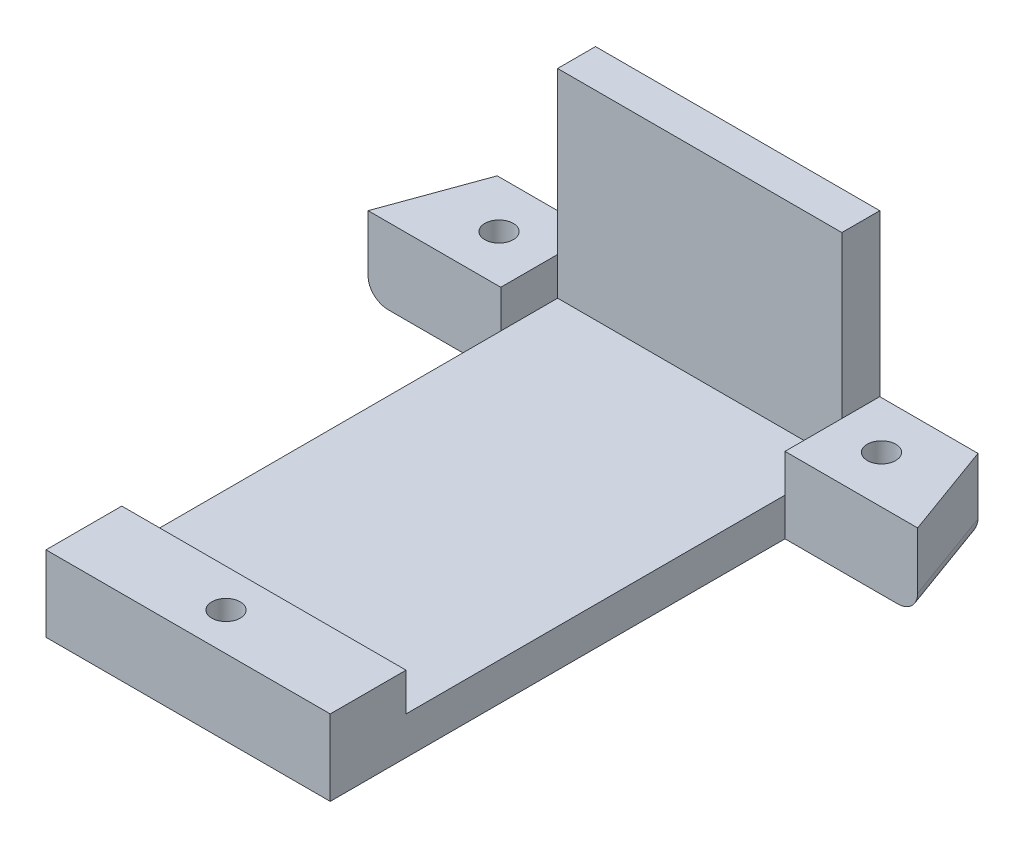
ISO-10303-21;
HEADER;
FILE_DESCRIPTION(('STEP AP214'),'2;1');
FILE_NAME('part.step','',(''),(''),'','','');
FILE_SCHEMA(('AUTOMOTIVE_DESIGN { 1 0 10303 214 1 1 1 1 }'));
ENDSEC;
DATA;
#1=APPLICATION_CONTEXT('core data for automotive mechanical design processes');
#2=APPLICATION_PROTOCOL_DEFINITION('international standard','automotive_design',2000,#1);
#3=PRODUCT_CONTEXT('',#1,'mechanical');
#4=PRODUCT('Part','Part','',(#3));
#5=PRODUCT_RELATED_PRODUCT_CATEGORY('part','',(#4));
#6=PRODUCT_DEFINITION_FORMATION('','',#4);
#7=PRODUCT_DEFINITION_CONTEXT('part definition',#1,'design');
#8=PRODUCT_DEFINITION('design','',#6,#7);
#9=PRODUCT_DEFINITION_SHAPE('','',#8);
#10=(LENGTH_UNIT() NAMED_UNIT(*) SI_UNIT(.MILLI.,.METRE.));
#11=(NAMED_UNIT(*) PLANE_ANGLE_UNIT() SI_UNIT($,.RADIAN.));
#12=(NAMED_UNIT(*) SI_UNIT($,.STERADIAN.) SOLID_ANGLE_UNIT());
#13=UNCERTAINTY_MEASURE_WITH_UNIT(LENGTH_MEASURE(1.E-05),#10,'distance_accuracy_value','');
#14=(GEOMETRIC_REPRESENTATION_CONTEXT(3) GLOBAL_UNCERTAINTY_ASSIGNED_CONTEXT((#13)) GLOBAL_UNIT_ASSIGNED_CONTEXT((#10,
#11,#12)) REPRESENTATION_CONTEXT('',''));
#15=CARTESIAN_POINT('',(0.,0.,0.));
#16=DIRECTION('',(0.,0.,1.));
#17=DIRECTION('',(1.,0.,0.));
#18=AXIS2_PLACEMENT_3D('',#15,#16,#17);
#19=CARTESIAN_POINT('',(0.,8.,29.));
#20=DIRECTION('',(0.,-1.,0.));
#21=DIRECTION('',(0.,0.,-1.));
#22=AXIS2_PLACEMENT_3D('',#19,#20,#21);
#23=CYLINDRICAL_SURFACE('',#22,1.5);
#24=CARTESIAN_POINT('',(0.,8.,29.));
#25=DIRECTION('',(0.,1.,0.));
#26=DIRECTION('',(0.,0.,1.));
#27=AXIS2_PLACEMENT_3D('',#24,#25,#26);
#28=CIRCLE('',#27,1.5);
#29=CARTESIAN_POINT('',(0.,8.,30.5));
#30=VERTEX_POINT('',#29);
#31=EDGE_CURVE('E319',#30,#30,#28,.T.);
#32=ORIENTED_EDGE('',*,*,#31,.T.);
#33=EDGE_LOOP('',(#32));
#34=FACE_BOUND('',#33,.T.);
#35=CARTESIAN_POINT('',(0.,4.,29.));
#36=DIRECTION('',(0.,-1.,0.));
#37=DIRECTION('',(0.,0.,-1.));
#38=AXIS2_PLACEMENT_3D('',#35,#36,#37);
#39=CIRCLE('',#38,1.5);
#40=CARTESIAN_POINT('',(0.,4.,27.5));
#41=VERTEX_POINT('',#40);
#42=EDGE_CURVE('E221',#41,#41,#39,.T.);
#43=ORIENTED_EDGE('',*,*,#42,.T.);
#44=EDGE_LOOP('',(#43));
#45=FACE_BOUND('',#44,.T.);
#46=ADVANCED_FACE('F39',(#34,#45),#23,.F.);
#47=CARTESIAN_POINT('',(-20.185,8.,-20.));
#48=DIRECTION('',(0.,-1.,0.));
#49=DIRECTION('',(0.,0.,-1.));
#50=AXIS2_PLACEMENT_3D('',#47,#48,#49);
#51=CYLINDRICAL_SURFACE('',#50,1.5);
#52=CARTESIAN_POINT('',(-20.185,8.,-20.));
#53=DIRECTION('',(0.,1.,0.));
#54=DIRECTION('',(0.,0.,1.));
#55=AXIS2_PLACEMENT_3D('',#52,#53,#54);
#56=CIRCLE('',#55,1.5);
#57=CARTESIAN_POINT('',(-20.185,8.,-18.5));
#58=VERTEX_POINT('',#57);
#59=EDGE_CURVE('E287',#58,#58,#56,.T.);
#60=ORIENTED_EDGE('',*,*,#59,.T.);
#61=EDGE_LOOP('',(#60));
#62=FACE_BOUND('',#61,.T.);
#63=CARTESIAN_POINT('',(-20.185,4.,-20.));
#64=DIRECTION('',(0.,-1.,0.));
#65=DIRECTION('',(0.,0.,-1.));
#66=AXIS2_PLACEMENT_3D('',#63,#64,#65);
#67=CIRCLE('',#66,1.5);
#68=CARTESIAN_POINT('',(-20.185,4.,-21.5));
#69=VERTEX_POINT('',#68);
#70=EDGE_CURVE('E376',#69,#69,#67,.T.);
#71=ORIENTED_EDGE('',*,*,#70,.T.);
#72=EDGE_LOOP('',(#71));
#73=FACE_BOUND('',#72,.T.);
#74=ADVANCED_FACE('F482',(#62,#73),#51,.F.);
#75=CARTESIAN_POINT('',(20.185,8.,-20.));
#76=DIRECTION('',(0.,-1.,0.));
#77=DIRECTION('',(0.,0.,-1.));
#78=AXIS2_PLACEMENT_3D('',#75,#76,#77);
#79=CYLINDRICAL_SURFACE('',#78,1.50000000000001);
#80=CARTESIAN_POINT('',(20.185,8.,-20.));
#81=DIRECTION('',(0.,1.,0.));
#82=DIRECTION('',(0.,0.,1.));
#83=AXIS2_PLACEMENT_3D('',#80,#81,#82);
#84=CIRCLE('',#83,1.50000000000001);
#85=CARTESIAN_POINT('',(20.185,8.,-18.5));
#86=VERTEX_POINT('',#85);
#87=EDGE_CURVE('E323',#86,#86,#84,.F.);
#88=ORIENTED_EDGE('',*,*,#87,.F.);
#89=EDGE_LOOP('',(#88));
#90=FACE_BOUND('',#89,.T.);
#91=CARTESIAN_POINT('',(20.185,4.,-20.));
#92=DIRECTION('',(0.,-1.,0.));
#93=DIRECTION('',(0.,0.,-1.));
#94=AXIS2_PLACEMENT_3D('',#91,#92,#93);
#95=CIRCLE('',#94,1.50000000000001);
#96=CARTESIAN_POINT('',(20.185,4.,-21.5));
#97=VERTEX_POINT('',#96);
#98=EDGE_CURVE('E372',#97,#97,#95,.F.);
#99=ORIENTED_EDGE('',*,*,#98,.F.);
#100=EDGE_LOOP('',(#99));
#101=FACE_BOUND('',#100,.T.);
#102=ADVANCED_FACE('F479',(#90,#101),#79,.F.);
#103=CARTESIAN_POINT('',(0.,8.,0.));
#104=DIRECTION('',(0.,1.,0.));
#105=DIRECTION('',(0.,0.,1.));
#106=AXIS2_PLACEMENT_3D('',#103,#104,#105);
#107=PLANE('',#106);
#108=DIRECTION('',(0.,0.,-1.));
#109=VECTOR('',#108,1.);
#110=CARTESIAN_POINT('',(15.,8.,-15.));
#111=LINE('',#110,#109);
#112=CARTESIAN_POINT('',(15.,8.,-15.));
#113=VERTEX_POINT('',#112);
#114=CARTESIAN_POINT('',(15.,8.,-21.));
#115=VERTEX_POINT('',#114);
#116=EDGE_CURVE('E208',#113,#115,#111,.T.);
#117=ORIENTED_EDGE('',*,*,#116,.F.);
#118=DIRECTION('',(-1.,0.,0.));
#119=VECTOR('',#118,1.);
#120=CARTESIAN_POINT('',(0.,8.,-15.));
#121=LINE('',#120,#119);
#122=CARTESIAN_POINT('',(29.,8.,-15.));
#123=VERTEX_POINT('',#122);
#124=EDGE_CURVE('E297',#123,#113,#121,.T.);
#125=ORIENTED_EDGE('',*,*,#124,.F.);
#126=DIRECTION('',(-0.341214696131743,0.,-0.939985388792678));
#127=VECTOR('',#126,1.);
#128=CARTESIAN_POINT('',(30.4346558352455,8.,-11.0477800681941));
#129=LINE('',#128,#127);
#130=CARTESIAN_POINT('',(25.37,8.,-25.));
#131=VERTEX_POINT('',#130);
#132=EDGE_CURVE('E311',#123,#131,#129,.T.);
#133=ORIENTED_EDGE('',*,*,#132,.T.);
#134=DIRECTION('',(-1.,0.,0.));
#135=VECTOR('',#134,1.);
#136=CARTESIAN_POINT('',(0.,8.,-25.));
#137=LINE('',#136,#135);
#138=CARTESIAN_POINT('',(15.,8.,-25.));
#139=VERTEX_POINT('',#138);
#140=EDGE_CURVE('E316',#131,#139,#137,.T.);
#141=ORIENTED_EDGE('',*,*,#140,.T.);
#142=DIRECTION('',(0.,0.,-1.));
#143=VECTOR('',#142,1.);
#144=CARTESIAN_POINT('',(15.,8.,-21.));
#145=LINE('',#144,#143);
#146=EDGE_CURVE('E249',#115,#139,#145,.T.);
#147=ORIENTED_EDGE('',*,*,#146,.F.);
#148=EDGE_LOOP('',(#117,#125,#133,#141,#147));
#149=FACE_BOUND('',#148,.T.);
#150=ORIENTED_EDGE('',*,*,#87,.T.);
#151=EDGE_LOOP('',(#150));
#152=FACE_BOUND('',#151,.T.);
#153=ADVANCED_FACE('F474',(#149,#152),#107,.T.);
#154=CARTESIAN_POINT('',(0.,8.,-15.));
#155=DIRECTION('',(0.,0.,-1.));
#156=DIRECTION('',(-1.,0.,0.));
#157=AXIS2_PLACEMENT_3D('',#154,#155,#156);
#158=PLANE('',#157);
#159=DIRECTION('',(1.,0.,0.));
#160=VECTOR('',#159,1.);
#161=CARTESIAN_POINT('',(0.,0.,-15.));
#162=LINE('',#161,#160);
#163=CARTESIAN_POINT('',(15.,0.,-15.));
#164=VERTEX_POINT('',#163);
#165=CARTESIAN_POINT('',(26.872307353023,0.,-15.));
#166=VERTEX_POINT('',#165);
#167=EDGE_CURVE('E292',#164,#166,#162,.T.);
#168=ORIENTED_EDGE('',*,*,#167,.T.);
#169=CARTESIAN_POINT('',(26.872307353023,2.,-15.));
#170=DIRECTION('',(0.,0.,-1.));
#171=DIRECTION('',(-1.,0.,0.));
#172=AXIS2_PLACEMENT_3D('',#169,#170,#171);
#173=ELLIPSE('',#172,2.127692646977,2.);
#174=CARTESIAN_POINT('',(29.,2.,-15.));
#175=VERTEX_POINT('',#174);
#176=EDGE_CURVE('E402',#166,#175,#173,.F.);
#177=ORIENTED_EDGE('',*,*,#176,.T.);
#178=DIRECTION('',(0.,-1.,0.));
#179=VECTOR('',#178,1.);
#180=CARTESIAN_POINT('',(29.,8.,-15.));
#181=LINE('',#180,#179);
#182=EDGE_CURVE('E351',#123,#175,#181,.T.);
#183=ORIENTED_EDGE('',*,*,#182,.F.);
#184=ORIENTED_EDGE('',*,*,#124,.T.);
#185=DIRECTION('',(0.,1.,0.));
#186=VECTOR('',#185,1.);
#187=CARTESIAN_POINT('',(15.,4.,-15.));
#188=LINE('',#187,#186);
#189=CARTESIAN_POINT('',(15.,4.,-15.));
#190=VERTEX_POINT('',#189);
#191=EDGE_CURVE('E227',#190,#113,#188,.T.);
#192=ORIENTED_EDGE('',*,*,#191,.F.);
#193=DIRECTION('',(0.,-1.,0.));
#194=VECTOR('',#193,1.);
#195=CARTESIAN_POINT('',(15.,8.,-15.));
#196=LINE('',#195,#194);
#197=EDGE_CURVE('E355',#190,#164,#196,.T.);
#198=ORIENTED_EDGE('',*,*,#197,.T.);
#199=EDGE_LOOP('',(#168,#177,#183,#184,#192,#198));
#200=FACE_BOUND('',#199,.T.);
#201=ADVANCED_FACE('F498',(#200),#158,.F.);
#202=DIRECTION('',(0.,0.,1.));
#203=VECTOR('',#202,1.);
#204=CARTESIAN_POINT('',(-15.,8.,-21.));
#205=LINE('',#204,#203);
#206=CARTESIAN_POINT('',(-15.,8.,-21.));
#207=VERTEX_POINT('',#206);
#208=CARTESIAN_POINT('',(-15.,8.,-15.));
#209=VERTEX_POINT('',#208);
#210=EDGE_CURVE('E212',#207,#209,#205,.T.);
#211=ORIENTED_EDGE('',*,*,#210,.F.);
#212=DIRECTION('',(0.,0.,1.));
#213=VECTOR('',#212,1.);
#214=CARTESIAN_POINT('',(-15.,8.,-25.));
#215=LINE('',#214,#213);
#216=CARTESIAN_POINT('',(-15.,8.,-25.));
#217=VERTEX_POINT('',#216);
#218=EDGE_CURVE('E257',#217,#207,#215,.T.);
#219=ORIENTED_EDGE('',*,*,#218,.F.);
#220=CARTESIAN_POINT('',(-25.37,8.,-25.));
#221=VERTEX_POINT('',#220);
#222=EDGE_CURVE('E315',#217,#221,#137,.T.);
#223=ORIENTED_EDGE('',*,*,#222,.T.);
#224=DIRECTION('',(0.341214696131742,0.,-0.939985388792678));
#225=VECTOR('',#224,1.);
#226=CARTESIAN_POINT('',(-30.4346558352455,8.,-11.0477800681941));
#227=LINE('',#226,#225);
#228=CARTESIAN_POINT('',(-29.,8.,-15.));
#229=VERTEX_POINT('',#228);
#230=EDGE_CURVE('E291',#229,#221,#227,.T.);
#231=ORIENTED_EDGE('',*,*,#230,.F.);
#232=EDGE_CURVE('E296',#209,#229,#121,.T.);
#233=ORIENTED_EDGE('',*,*,#232,.F.);
#234=EDGE_LOOP('',(#211,#219,#223,#231,#233));
#235=FACE_BOUND('',#234,.T.);
#236=ORIENTED_EDGE('',*,*,#59,.F.);
#237=EDGE_LOOP('',(#236));
#238=FACE_BOUND('',#237,.T.);
#239=ADVANCED_FACE('F475',(#235,#238),#107,.T.);
#240=CARTESIAN_POINT('',(-30.4346558352455,8.,-11.0477800681941));
#241=DIRECTION('',(-0.939985388792678,0.,-0.341214696131742));
#242=DIRECTION('',(-0.341214696131742,0.,0.939985388792678));
#243=AXIS2_PLACEMENT_3D('',#240,#241,#242);
#244=PLANE('',#243);
#245=DIRECTION('',(0.,-1.,0.));
#246=VECTOR('',#245,1.);
#247=CARTESIAN_POINT('',(-25.37,8.,-25.));
#248=LINE('',#247,#246);
#249=CARTESIAN_POINT('',(-25.37,2.,-25.));
#250=VERTEX_POINT('',#249);
#251=EDGE_CURVE('E327',#221,#250,#248,.T.);
#252=ORIENTED_EDGE('',*,*,#251,.T.);
#253=DIRECTION('',(0.341214696131742,0.,-0.939985388792678));
#254=VECTOR('',#253,1.);
#255=CARTESIAN_POINT('',(-29.,2.,-15.));
#256=LINE('',#255,#254);
#257=CARTESIAN_POINT('',(-29.,2.,-15.));
#258=VERTEX_POINT('',#257);
#259=EDGE_CURVE('E64',#250,#258,#256,.F.);
#260=ORIENTED_EDGE('',*,*,#259,.T.);
#261=DIRECTION('',(0.,-1.,0.));
#262=VECTOR('',#261,1.);
#263=CARTESIAN_POINT('',(-29.,8.,-15.));
#264=LINE('',#263,#262);
#265=EDGE_CURVE('E368',#229,#258,#264,.T.);
#266=ORIENTED_EDGE('',*,*,#265,.F.);
#267=ORIENTED_EDGE('',*,*,#230,.T.);
#268=EDGE_LOOP('',(#252,#260,#266,#267));
#269=FACE_BOUND('',#268,.T.);
#270=ADVANCED_FACE('F509',(#269),#244,.T.);
#271=CARTESIAN_POINT('',(-15.,8.,0.));
#272=DIRECTION('',(1.,0.,0.));
#273=DIRECTION('',(0.,0.,-1.));
#274=AXIS2_PLACEMENT_3D('',#271,#272,#273);
#275=PLANE('',#274);
#276=DIRECTION('',(0.,0.,1.));
#277=VECTOR('',#276,1.);
#278=CARTESIAN_POINT('',(-15.,8.,0.));
#279=LINE('',#278,#277);
#280=CARTESIAN_POINT('',(-15.,8.,25.));
#281=VERTEX_POINT('',#280);
#282=CARTESIAN_POINT('',(-15.,8.,33.));
#283=VERTEX_POINT('',#282);
#284=EDGE_CURVE('E301',#281,#283,#279,.T.);
#285=ORIENTED_EDGE('',*,*,#284,.F.);
#286=DIRECTION('',(0.,1.,0.));
#287=VECTOR('',#286,1.);
#288=CARTESIAN_POINT('',(-15.,4.,25.));
#289=LINE('',#288,#287);
#290=CARTESIAN_POINT('',(-15.,4.,25.));
#291=VERTEX_POINT('',#290);
#292=EDGE_CURVE('E242',#291,#281,#289,.T.);
#293=ORIENTED_EDGE('',*,*,#292,.F.);
#294=DIRECTION('',(0.,0.,1.));
#295=VECTOR('',#294,1.);
#296=CARTESIAN_POINT('',(-15.,4.,25.));
#297=LINE('',#296,#295);
#298=CARTESIAN_POINT('',(-15.,4.,-15.));
#299=VERTEX_POINT('',#298);
#300=EDGE_CURVE('E232',#299,#291,#297,.T.);
#301=ORIENTED_EDGE('',*,*,#300,.F.);
#302=DIRECTION('',(0.,-1.,0.));
#303=VECTOR('',#302,1.);
#304=CARTESIAN_POINT('',(-15.,8.,-15.));
#305=LINE('',#304,#303);
#306=CARTESIAN_POINT('',(-15.,0.,-15.));
#307=VERTEX_POINT('',#306);
#308=EDGE_CURVE('E365',#299,#307,#305,.T.);
#309=ORIENTED_EDGE('',*,*,#308,.T.);
#310=DIRECTION('',(0.,0.,1.));
#311=VECTOR('',#310,1.);
#312=CARTESIAN_POINT('',(-15.,0.,0.));
#313=LINE('',#312,#311);
#314=CARTESIAN_POINT('',(-15.,0.,33.));
#315=VERTEX_POINT('',#314);
#316=EDGE_CURVE('E331',#307,#315,#313,.T.);
#317=ORIENTED_EDGE('',*,*,#316,.T.);
#318=DIRECTION('',(0.,-1.,0.));
#319=VECTOR('',#318,1.);
#320=CARTESIAN_POINT('',(-15.,8.,33.));
#321=LINE('',#320,#319);
#322=EDGE_CURVE('E361',#283,#315,#321,.T.);
#323=ORIENTED_EDGE('',*,*,#322,.F.);
#324=EDGE_LOOP('',(#285,#293,#301,#309,#317,#323));
#325=FACE_BOUND('',#324,.T.);
#326=ADVANCED_FACE('F505',(#325),#275,.F.);
#327=CARTESIAN_POINT('',(0.,8.,33.));
#328=DIRECTION('',(0.,0.,-1.));
#329=DIRECTION('',(-1.,0.,0.));
#330=AXIS2_PLACEMENT_3D('',#327,#328,#329);
#331=PLANE('',#330);
#332=DIRECTION('',(1.,0.,0.));
#333=VECTOR('',#332,1.);
#334=CARTESIAN_POINT('',(0.,0.,33.));
#335=LINE('',#334,#333);
#336=CARTESIAN_POINT('',(15.,0.,33.));
#337=VERTEX_POINT('',#336);
#338=EDGE_CURVE('E335',#315,#337,#335,.T.);
#339=ORIENTED_EDGE('',*,*,#338,.T.);
#340=DIRECTION('',(0.,-1.,0.));
#341=VECTOR('',#340,1.);
#342=CARTESIAN_POINT('',(15.,8.,33.));
#343=LINE('',#342,#341);
#344=CARTESIAN_POINT('',(15.,8.,33.));
#345=VERTEX_POINT('',#344);
#346=EDGE_CURVE('E358',#345,#337,#343,.T.);
#347=ORIENTED_EDGE('',*,*,#346,.F.);
#348=DIRECTION('',(1.,0.,0.));
#349=VECTOR('',#348,1.);
#350=CARTESIAN_POINT('',(0.,8.,33.));
#351=LINE('',#350,#349);
#352=EDGE_CURVE('E304',#283,#345,#351,.T.);
#353=ORIENTED_EDGE('',*,*,#352,.F.);
#354=ORIENTED_EDGE('',*,*,#322,.T.);
#355=EDGE_LOOP('',(#339,#347,#353,#354));
#356=FACE_BOUND('',#355,.T.);
#357=ADVANCED_FACE('F501',(#356),#331,.F.);
#358=CARTESIAN_POINT('',(15.,8.,0.));
#359=DIRECTION('',(1.,0.,0.));
#360=DIRECTION('',(0.,0.,-1.));
#361=AXIS2_PLACEMENT_3D('',#358,#359,#360);
#362=PLANE('',#361);
#363=DIRECTION('',(0.,1.,0.));
#364=VECTOR('',#363,1.);
#365=CARTESIAN_POINT('',(15.,4.,25.));
#366=LINE('',#365,#364);
#367=CARTESIAN_POINT('',(15.,4.,25.));
#368=VERTEX_POINT('',#367);
#369=CARTESIAN_POINT('',(15.,8.,25.));
#370=VERTEX_POINT('',#369);
#371=EDGE_CURVE('E245',#368,#370,#366,.T.);
#372=ORIENTED_EDGE('',*,*,#371,.T.);
#373=DIRECTION('',(0.,0.,1.));
#374=VECTOR('',#373,1.);
#375=CARTESIAN_POINT('',(15.,8.,0.));
#376=LINE('',#375,#374);
#377=EDGE_CURVE('E308',#370,#345,#376,.T.);
#378=ORIENTED_EDGE('',*,*,#377,.T.);
#379=ORIENTED_EDGE('',*,*,#346,.T.);
#380=DIRECTION('',(0.,0.,1.));
#381=VECTOR('',#380,1.);
#382=CARTESIAN_POINT('',(15.,0.,0.));
#383=LINE('',#382,#381);
#384=EDGE_CURVE('E339',#164,#337,#383,.T.);
#385=ORIENTED_EDGE('',*,*,#384,.F.);
#386=ORIENTED_EDGE('',*,*,#197,.F.);
#387=DIRECTION('',(0.,0.,-1.));
#388=VECTOR('',#387,1.);
#389=CARTESIAN_POINT('',(15.,4.,-15.));
#390=LINE('',#389,#388);
#391=EDGE_CURVE('E239',#368,#190,#390,.T.);
#392=ORIENTED_EDGE('',*,*,#391,.F.);
#393=EDGE_LOOP('',(#372,#378,#379,#385,#386,#392));
#394=FACE_BOUND('',#393,.T.);
#395=ADVANCED_FACE('F496',(#394),#362,.T.);
#396=ORIENTED_EDGE('',*,*,#265,.T.);
#397=CARTESIAN_POINT('',(-26.872307353023,2.,-15.));
#398=DIRECTION('',(0.,0.,-1.));
#399=DIRECTION('',(-1.,0.,0.));
#400=AXIS2_PLACEMENT_3D('',#397,#398,#399);
#401=ELLIPSE('',#400,2.127692646977,2.);
#402=CARTESIAN_POINT('',(-26.872307353023,0.,-15.));
#403=VERTEX_POINT('',#402);
#404=EDGE_CURVE('E407',#258,#403,#401,.F.);
#405=ORIENTED_EDGE('',*,*,#404,.T.);
#406=DIRECTION('',(-1.,0.,0.));
#407=VECTOR('',#406,1.);
#408=CARTESIAN_POINT('',(0.,0.,-15.));
#409=LINE('',#408,#407);
#410=EDGE_CURVE('E286',#307,#403,#409,.T.);
#411=ORIENTED_EDGE('',*,*,#410,.F.);
#412=ORIENTED_EDGE('',*,*,#308,.F.);
#413=DIRECTION('',(0.,1.,0.));
#414=VECTOR('',#413,1.);
#415=CARTESIAN_POINT('',(-15.,4.,-15.));
#416=LINE('',#415,#414);
#417=EDGE_CURVE('E193',#299,#209,#416,.T.);
#418=ORIENTED_EDGE('',*,*,#417,.T.);
#419=ORIENTED_EDGE('',*,*,#232,.T.);
#420=EDGE_LOOP('',(#396,#405,#411,#412,#418,#419));
#421=FACE_BOUND('',#420,.T.);
#422=ADVANCED_FACE('F492',(#421),#158,.F.);
#423=CARTESIAN_POINT('',(30.4346558352455,8.,-11.0477800681941));
#424=DIRECTION('',(-0.939985388792678,0.,0.341214696131743));
#425=DIRECTION('',(0.341214696131743,0.,0.939985388792678));
#426=AXIS2_PLACEMENT_3D('',#423,#424,#425);
#427=PLANE('',#426);
#428=ORIENTED_EDGE('',*,*,#182,.T.);
#429=DIRECTION('',(-0.341214696131743,0.,-0.939985388792678));
#430=VECTOR('',#429,1.);
#431=CARTESIAN_POINT('',(30.4346558352455,2.,-11.0477800681941));
#432=LINE('',#431,#430);
#433=CARTESIAN_POINT('',(25.37,2.,-25.));
#434=VERTEX_POINT('',#433);
#435=EDGE_CURVE('E371',#175,#434,#432,.T.);
#436=ORIENTED_EDGE('',*,*,#435,.T.);
#437=DIRECTION('',(0.,-1.,0.));
#438=VECTOR('',#437,1.);
#439=CARTESIAN_POINT('',(25.37,8.,-25.));
#440=LINE('',#439,#438);
#441=EDGE_CURVE('E348',#131,#434,#440,.T.);
#442=ORIENTED_EDGE('',*,*,#441,.F.);
#443=ORIENTED_EDGE('',*,*,#132,.F.);
#444=EDGE_LOOP('',(#428,#436,#442,#443));
#445=FACE_BOUND('',#444,.T.);
#446=ADVANCED_FACE('F489',(#445),#427,.F.);
#447=CARTESIAN_POINT('',(0.,8.,-25.));
#448=DIRECTION('',(0.,0.,1.));
#449=DIRECTION('',(1.,0.,0.));
#450=AXIS2_PLACEMENT_3D('',#447,#448,#449);
#451=PLANE('',#450);
#452=ORIENTED_EDGE('',*,*,#441,.T.);
#453=DIRECTION('',(-1.,0.,0.));
#454=VECTOR('',#453,1.);
#455=CARTESIAN_POINT('',(0.,2.,-25.));
#456=LINE('',#455,#454);
#457=EDGE_CURVE('E57',#434,#250,#456,.T.);
#458=ORIENTED_EDGE('',*,*,#457,.T.);
#459=ORIENTED_EDGE('',*,*,#251,.F.);
#460=ORIENTED_EDGE('',*,*,#222,.F.);
#461=DIRECTION('',(0.,-1.,0.));
#462=VECTOR('',#461,1.);
#463=CARTESIAN_POINT('',(-15.,25.,-25.));
#464=LINE('',#463,#462);
#465=CARTESIAN_POINT('',(-15.,25.,-25.));
#466=VERTEX_POINT('',#465);
#467=EDGE_CURVE('E274',#466,#217,#464,.T.);
#468=ORIENTED_EDGE('',*,*,#467,.F.);
#469=DIRECTION('',(-1.,0.,0.));
#470=VECTOR('',#469,1.);
#471=CARTESIAN_POINT('',(15.,25.,-25.));
#472=LINE('',#471,#470);
#473=CARTESIAN_POINT('',(15.,25.,-25.));
#474=VERTEX_POINT('',#473);
#475=EDGE_CURVE('E260',#474,#466,#472,.T.);
#476=ORIENTED_EDGE('',*,*,#475,.F.);
#477=DIRECTION('',(0.,-1.,0.));
#478=VECTOR('',#477,1.);
#479=CARTESIAN_POINT('',(15.,25.,-25.));
#480=LINE('',#479,#478);
#481=EDGE_CURVE('E278',#474,#139,#480,.T.);
#482=ORIENTED_EDGE('',*,*,#481,.T.);
#483=ORIENTED_EDGE('',*,*,#140,.F.);
#484=EDGE_LOOP('',(#452,#458,#459,#460,#468,#476,#482,#483));
#485=FACE_BOUND('',#484,.T.);
#486=ADVANCED_FACE('F472',(#485),#451,.F.);
#487=DIRECTION('',(1.,0.,0.));
#488=VECTOR('',#487,1.);
#489=CARTESIAN_POINT('',(15.,8.,25.));
#490=LINE('',#489,#488);
#491=EDGE_CURVE('E226',#281,#370,#490,.T.);
#492=ORIENTED_EDGE('',*,*,#491,.F.);
#493=ORIENTED_EDGE('',*,*,#284,.T.);
#494=ORIENTED_EDGE('',*,*,#352,.T.);
#495=ORIENTED_EDGE('',*,*,#377,.F.);
#496=EDGE_LOOP('',(#492,#493,#494,#495));
#497=FACE_BOUND('',#496,.T.);
#498=ORIENTED_EDGE('',*,*,#31,.F.);
#499=EDGE_LOOP('',(#498));
#500=FACE_BOUND('',#499,.T.);
#501=ADVANCED_FACE('F469',(#497,#500),#107,.T.);
#502=CARTESIAN_POINT('',(0.,0.,0.));
#503=DIRECTION('',(0.,1.,0.));
#504=DIRECTION('',(0.,0.,1.));
#505=AXIS2_PLACEMENT_3D('',#502,#503,#504);
#506=PLANE('',#505);
#507=CARTESIAN_POINT('',(0.,0.,29.));
#508=DIRECTION('',(0.,-1.,0.));
#509=DIRECTION('',(0.,0.,-1.));
#510=AXIS2_PLACEMENT_3D('',#507,#508,#509);
#511=CIRCLE('',#510,3.25);
#512=CARTESIAN_POINT('',(0.,0.,25.75));
#513=VERTEX_POINT('',#512);
#514=EDGE_CURVE('E568',#513,#513,#511,.T.);
#515=ORIENTED_EDGE('',*,*,#514,.F.);
#516=EDGE_LOOP('',(#515));
#517=FACE_BOUND('',#516,.T.);
#518=ORIENTED_EDGE('',*,*,#410,.T.);
#519=DIRECTION('',(0.341214696131742,0.,-0.939985388792678));
#520=VECTOR('',#519,1.);
#521=CARTESIAN_POINT('',(-23.4900292224146,0.,-24.3175706077365));
#522=LINE('',#521,#520);
#523=CARTESIAN_POINT('',(-23.968307353023,0.,-23.));
#524=VERTEX_POINT('',#523);
#525=EDGE_CURVE('E399',#403,#524,#522,.T.);
#526=ORIENTED_EDGE('',*,*,#525,.T.);
#527=DIRECTION('',(-1.,0.,0.));
#528=VECTOR('',#527,1.);
#529=CARTESIAN_POINT('',(0.,0.,-23.));
#530=LINE('',#529,#528);
#531=CARTESIAN_POINT('',(-21.435,0.,-23.));
#532=VERTEX_POINT('',#531);
#533=EDGE_CURVE('E396',#524,#532,#530,.F.);
#534=ORIENTED_EDGE('',*,*,#533,.T.);
#535=CARTESIAN_POINT('',(-20.185,0.,-20.));
#536=DIRECTION('',(0.,-1.,0.));
#537=DIRECTION('',(0.,0.,-1.));
#538=AXIS2_PLACEMENT_3D('',#535,#536,#537);
#539=CIRCLE('',#538,3.25);
#540=CARTESIAN_POINT('',(-18.935,0.,-23.));
#541=VERTEX_POINT('',#540);
#542=EDGE_CURVE('E558',#541,#532,#539,.T.);
#543=ORIENTED_EDGE('',*,*,#542,.F.);
#544=DIRECTION('',(-1.,0.,0.));
#545=VECTOR('',#544,1.);
#546=CARTESIAN_POINT('',(0.,0.,-23.));
#547=LINE('',#546,#545);
#548=CARTESIAN_POINT('',(18.935,0.,-23.));
#549=VERTEX_POINT('',#548);
#550=EDGE_CURVE('E393',#541,#549,#547,.F.);
#551=ORIENTED_EDGE('',*,*,#550,.T.);
#552=CARTESIAN_POINT('',(20.185,0.,-20.));
#553=DIRECTION('',(0.,-1.,0.));
#554=DIRECTION('',(0.,0.,-1.));
#555=AXIS2_PLACEMENT_3D('',#552,#553,#554);
#556=CIRCLE('',#555,3.25);
#557=CARTESIAN_POINT('',(21.435,0.,-23.));
#558=VERTEX_POINT('',#557);
#559=EDGE_CURVE('E215',#558,#549,#556,.T.);
#560=ORIENTED_EDGE('',*,*,#559,.F.);
#561=DIRECTION('',(-1.,0.,0.));
#562=VECTOR('',#561,1.);
#563=CARTESIAN_POINT('',(0.,0.,-23.));
#564=LINE('',#563,#562);
#565=CARTESIAN_POINT('',(23.968307353023,0.,-23.));
#566=VERTEX_POINT('',#565);
#567=EDGE_CURVE('E387',#558,#566,#564,.F.);
#568=ORIENTED_EDGE('',*,*,#567,.T.);
#569=DIRECTION('',(-0.341214696131743,0.,-0.939985388792678));
#570=VECTOR('',#569,1.);
#571=CARTESIAN_POINT('',(28.5546850576602,0.,-10.3653506759307));
#572=LINE('',#571,#570);
#573=EDGE_CURVE('E390',#566,#166,#572,.F.);
#574=ORIENTED_EDGE('',*,*,#573,.T.);
#575=ORIENTED_EDGE('',*,*,#167,.F.);
#576=ORIENTED_EDGE('',*,*,#384,.T.);
#577=ORIENTED_EDGE('',*,*,#338,.F.);
#578=ORIENTED_EDGE('',*,*,#316,.F.);
#579=EDGE_LOOP('',(#518,#526,#534,#543,#551,#560,#568,#574,#575,#576,#577,#578));
#580=FACE_BOUND('',#579,.T.);
#581=ADVANCED_FACE('F468',(#517,#580),#506,.F.);
#582=CARTESIAN_POINT('',(-15.,25.,-21.));
#583=DIRECTION('',(0.,0.,-1.));
#584=DIRECTION('',(-1.,0.,0.));
#585=AXIS2_PLACEMENT_3D('',#582,#583,#584);
#586=PLANE('',#585);
#587=DIRECTION('',(0.,-1.,0.));
#588=VECTOR('',#587,1.);
#589=CARTESIAN_POINT('',(-15.,25.,-21.));
#590=LINE('',#589,#588);
#591=CARTESIAN_POINT('',(-15.,25.,-21.));
#592=VERTEX_POINT('',#591);
#593=EDGE_CURVE('E189',#592,#207,#590,.T.);
#594=ORIENTED_EDGE('',*,*,#593,.T.);
#595=DIRECTION('',(0.,1.,0.));
#596=VECTOR('',#595,1.);
#597=CARTESIAN_POINT('',(-15.,4.,-21.));
#598=LINE('',#597,#596);
#599=CARTESIAN_POINT('',(-15.,4.,-21.));
#600=VERTEX_POINT('',#599);
#601=EDGE_CURVE('E181',#600,#207,#598,.T.);
#602=ORIENTED_EDGE('',*,*,#601,.F.);
#603=DIRECTION('',(-1.,0.,0.));
#604=VECTOR('',#603,1.);
#605=CARTESIAN_POINT('',(15.,4.,-21.));
#606=LINE('',#605,#604);
#607=CARTESIAN_POINT('',(15.,4.,-21.));
#608=VERTEX_POINT('',#607);
#609=EDGE_CURVE('E185',#608,#600,#606,.T.);
#610=ORIENTED_EDGE('',*,*,#609,.F.);
#611=DIRECTION('',(0.,1.,0.));
#612=VECTOR('',#611,1.);
#613=CARTESIAN_POINT('',(15.,4.,-21.));
#614=LINE('',#613,#612);
#615=EDGE_CURVE('E223',#608,#115,#614,.T.);
#616=ORIENTED_EDGE('',*,*,#615,.T.);
#617=DIRECTION('',(0.,-1.,0.));
#618=VECTOR('',#617,1.);
#619=CARTESIAN_POINT('',(15.,25.,-21.));
#620=LINE('',#619,#618);
#621=CARTESIAN_POINT('',(15.,25.,-21.));
#622=VERTEX_POINT('',#621);
#623=EDGE_CURVE('E282',#622,#115,#620,.T.);
#624=ORIENTED_EDGE('',*,*,#623,.F.);
#625=DIRECTION('',(1.,0.,0.));
#626=VECTOR('',#625,1.);
#627=CARTESIAN_POINT('',(-15.,25.,-21.));
#628=LINE('',#627,#626);
#629=EDGE_CURVE('E252',#592,#622,#628,.T.);
#630=ORIENTED_EDGE('',*,*,#629,.F.);
#631=EDGE_LOOP('',(#594,#602,#610,#616,#624,#630));
#632=FACE_BOUND('',#631,.T.);
#633=ADVANCED_FACE('F183',(#632),#586,.F.);
#634=CARTESIAN_POINT('',(15.,25.,-21.));
#635=DIRECTION('',(-1.,0.,0.));
#636=DIRECTION('',(0.,0.,1.));
#637=AXIS2_PLACEMENT_3D('',#634,#635,#636);
#638=PLANE('',#637);
#639=ORIENTED_EDGE('',*,*,#146,.T.);
#640=ORIENTED_EDGE('',*,*,#481,.F.);
#641=DIRECTION('',(0.,0.,-1.));
#642=VECTOR('',#641,1.);
#643=CARTESIAN_POINT('',(15.,25.,-21.));
#644=LINE('',#643,#642);
#645=EDGE_CURVE('E256',#622,#474,#644,.T.);
#646=ORIENTED_EDGE('',*,*,#645,.F.);
#647=ORIENTED_EDGE('',*,*,#623,.T.);
#648=EDGE_LOOP('',(#639,#640,#646,#647));
#649=FACE_BOUND('',#648,.T.);
#650=ADVANCED_FACE('F461',(#649),#638,.F.);
#651=CARTESIAN_POINT('',(-15.,25.,-25.));
#652=DIRECTION('',(1.,0.,0.));
#653=DIRECTION('',(0.,0.,-1.));
#654=AXIS2_PLACEMENT_3D('',#651,#652,#653);
#655=PLANE('',#654);
#656=ORIENTED_EDGE('',*,*,#218,.T.);
#657=ORIENTED_EDGE('',*,*,#593,.F.);
#658=DIRECTION('',(0.,0.,1.));
#659=VECTOR('',#658,1.);
#660=CARTESIAN_POINT('',(-15.,25.,-25.));
#661=LINE('',#660,#659);
#662=EDGE_CURVE('E263',#466,#592,#661,.T.);
#663=ORIENTED_EDGE('',*,*,#662,.F.);
#664=ORIENTED_EDGE('',*,*,#467,.T.);
#665=EDGE_LOOP('',(#656,#657,#663,#664));
#666=FACE_BOUND('',#665,.T.);
#667=ADVANCED_FACE('F457',(#666),#655,.F.);
#668=CARTESIAN_POINT('',(0.,25.,0.));
#669=DIRECTION('',(0.,1.,0.));
#670=DIRECTION('',(0.,0.,1.));
#671=AXIS2_PLACEMENT_3D('',#668,#669,#670);
#672=PLANE('',#671);
#673=ORIENTED_EDGE('',*,*,#629,.T.);
#674=ORIENTED_EDGE('',*,*,#645,.T.);
#675=ORIENTED_EDGE('',*,*,#475,.T.);
#676=ORIENTED_EDGE('',*,*,#662,.T.);
#677=EDGE_LOOP('',(#673,#674,#675,#676));
#678=FACE_BOUND('',#677,.T.);
#679=ADVANCED_FACE('F453',(#678),#672,.T.);
#680=CARTESIAN_POINT('',(15.,4.,25.));
#681=DIRECTION('',(0.,0.,1.));
#682=DIRECTION('',(1.,0.,0.));
#683=AXIS2_PLACEMENT_3D('',#680,#681,#682);
#684=PLANE('',#683);
#685=ORIENTED_EDGE('',*,*,#491,.T.);
#686=ORIENTED_EDGE('',*,*,#371,.F.);
#687=DIRECTION('',(1.,0.,0.));
#688=VECTOR('',#687,1.);
#689=CARTESIAN_POINT('',(15.,4.,25.));
#690=LINE('',#689,#688);
#691=EDGE_CURVE('E235',#291,#368,#690,.T.);
#692=ORIENTED_EDGE('',*,*,#691,.F.);
#693=ORIENTED_EDGE('',*,*,#292,.T.);
#694=EDGE_LOOP('',(#685,#686,#692,#693));
#695=FACE_BOUND('',#694,.T.);
#696=ADVANCED_FACE('F450',(#695),#684,.F.);
#697=CARTESIAN_POINT('',(0.,4.,0.));
#698=DIRECTION('',(0.,-1.,0.));
#699=DIRECTION('',(0.,0.,-1.));
#700=AXIS2_PLACEMENT_3D('',#697,#698,#699);
#701=PLANE('',#700);
#702=ORIENTED_EDGE('',*,*,#300,.T.);
#703=ORIENTED_EDGE('',*,*,#691,.T.);
#704=ORIENTED_EDGE('',*,*,#391,.T.);
#705=DIRECTION('',(0.,0.,-1.));
#706=VECTOR('',#705,1.);
#707=CARTESIAN_POINT('',(15.,4.,-15.));
#708=LINE('',#707,#706);
#709=EDGE_CURVE('E194',#190,#608,#708,.T.);
#710=ORIENTED_EDGE('',*,*,#709,.T.);
#711=ORIENTED_EDGE('',*,*,#609,.T.);
#712=DIRECTION('',(0.,0.,1.));
#713=VECTOR('',#712,1.);
#714=CARTESIAN_POINT('',(-15.,4.,-21.));
#715=LINE('',#714,#713);
#716=EDGE_CURVE('E197',#600,#299,#715,.T.);
#717=ORIENTED_EDGE('',*,*,#716,.T.);
#718=EDGE_LOOP('',(#702,#703,#704,#710,#711,#717));
#719=FACE_BOUND('',#718,.T.);
#720=ADVANCED_FACE('F205',(#719),#701,.F.);
#721=CARTESIAN_POINT('',(15.,4.,-15.));
#722=DIRECTION('',(1.,0.,0.));
#723=DIRECTION('',(0.,0.,-1.));
#724=AXIS2_PLACEMENT_3D('',#721,#722,#723);
#725=PLANE('',#724);
#726=ORIENTED_EDGE('',*,*,#116,.T.);
#727=ORIENTED_EDGE('',*,*,#615,.F.);
#728=ORIENTED_EDGE('',*,*,#709,.F.);
#729=ORIENTED_EDGE('',*,*,#191,.T.);
#730=EDGE_LOOP('',(#726,#727,#728,#729));
#731=FACE_BOUND('',#730,.T.);
#732=ADVANCED_FACE('F442',(#731),#725,.F.);
#733=CARTESIAN_POINT('',(-15.,4.,-21.));
#734=DIRECTION('',(-1.,0.,0.));
#735=DIRECTION('',(0.,0.,1.));
#736=AXIS2_PLACEMENT_3D('',#733,#734,#735);
#737=PLANE('',#736);
#738=ORIENTED_EDGE('',*,*,#210,.T.);
#739=ORIENTED_EDGE('',*,*,#417,.F.);
#740=ORIENTED_EDGE('',*,*,#716,.F.);
#741=ORIENTED_EDGE('',*,*,#601,.T.);
#742=EDGE_LOOP('',(#738,#739,#740,#741));
#743=FACE_BOUND('',#742,.T.);
#744=ADVANCED_FACE('F198',(#743),#737,.F.);
#745=CARTESIAN_POINT('',(20.185,4.,-20.));
#746=DIRECTION('',(0.,-1.,0.));
#747=DIRECTION('',(0.,0.,-1.));
#748=AXIS2_PLACEMENT_3D('',#745,#746,#747);
#749=PLANE('',#748);
#750=CARTESIAN_POINT('',(20.185,4.,-20.));
#751=DIRECTION('',(0.,-1.,0.));
#752=DIRECTION('',(0.,0.,-1.));
#753=AXIS2_PLACEMENT_3D('',#750,#751,#752);
#754=CIRCLE('',#753,3.25);
#755=CARTESIAN_POINT('',(20.185,4.,-23.25));
#756=VERTEX_POINT('',#755);
#757=EDGE_CURVE('E554',#756,#756,#754,.T.);
#758=ORIENTED_EDGE('',*,*,#757,.T.);
#759=EDGE_LOOP('',(#758));
#760=FACE_BOUND('',#759,.T.);
#761=ORIENTED_EDGE('',*,*,#98,.T.);
#762=EDGE_LOOP('',(#761));
#763=FACE_BOUND('',#762,.T.);
#764=ADVANCED_FACE('F435',(#760,#763),#749,.T.);
#765=CARTESIAN_POINT('',(20.185,4.,-20.));
#766=DIRECTION('',(0.,-1.,0.));
#767=DIRECTION('',(0.,0.,-1.));
#768=AXIS2_PLACEMENT_3D('',#765,#766,#767);
#769=CYLINDRICAL_SURFACE('',#768,3.25);
#770=ORIENTED_EDGE('',*,*,#757,.F.);
#771=EDGE_LOOP('',(#770));
#772=FACE_BOUND('',#771,.T.);
#773=ORIENTED_EDGE('',*,*,#559,.T.);
#774=CARTESIAN_POINT('',(18.935,0.,-23.));
#775=CARTESIAN_POINT('',(19.013180651089,2.73352821365081E-05,-23.0325826433731));
#776=CARTESIAN_POINT('',(19.0926309951941,0.00079725406119177,-23.062092962237));
#777=CARTESIAN_POINT('',(19.2535768294571,0.0031169759156716,-23.1148209300555));
#778=CARTESIAN_POINT('',(19.3350721704711,0.00466672227362108,-23.1380390364588));
#779=CARTESIAN_POINT('',(19.4996796950792,0.00784207554558613,-23.178052569348));
#780=CARTESIAN_POINT('',(19.5827929125147,0.00946773196130357,-23.1948437372386));
#781=CARTESIAN_POINT('',(19.7500844033269,0.0122990942134182,-23.2218825728045));
#782=CARTESIAN_POINT('',(19.8342626885732,0.0135047953654067,-23.2321301674902));
#783=CARTESIAN_POINT('',(20.0096654633171,0.0152402101486043,-23.2465495330635));
#784=CARTESIAN_POINT('',(20.1009344021252,0.0157108678280327,-23.2501939838992));
#785=CARTESIAN_POINT('',(20.2834557774676,0.015660158214346,-23.2497900870626));
#786=CARTESIAN_POINT('',(20.37470821353,0.0151387660103558,-23.2457415462154));
#787=CARTESIAN_POINT('',(20.5564169908669,0.0132524167406104,-23.2299930467997));
#788=CARTESIAN_POINT('',(20.6468742341478,0.0118885895978492,-23.2183033357946));
#789=CARTESIAN_POINT('',(20.8264448830884,0.00873622516642992,-23.1873728133012));
#790=CARTESIAN_POINT('',(20.9155588311143,0.00694786445213581,-23.168135139038));
#791=CARTESIAN_POINT('',(21.077214371529,0.00388361922286207,-23.126055513369));
#792=CARTESIAN_POINT('',(21.1500511244395,0.00257194514172688,-23.1043421592508));
#793=CARTESIAN_POINT('',(21.2939282782223,0.000639115257367233,-23.0559021079313));
#794=CARTESIAN_POINT('',(21.3649711415719,1.69562342524708E-05,-23.0291827606681));
#795=CARTESIAN_POINT('',(21.435,0.,-23.));
#796=B_SPLINE_CURVE_WITH_KNOTS('',3,(#774,#775,#776,#777,#778,#779,#780,#781,#782,#783,#784,
#785,#786,#787,#788,#789,#790,#791,#792,#793,#794,#795),.UNSPECIFIED.,.F.,.F.,(4,2,2,2,2,2,2,2,
2,2,4),(0.,0.254014759203591,0.50801104638304,0.762175345518384,1.0163424796494,
1.29003808885995,1.5637405707966,1.83707674170351,2.1102994236891,2.33816238427443,
2.56569337532258),.UNSPECIFIED.);
#797=EDGE_CURVE('E11',#549,#558,#796,.T.);
#798=ORIENTED_EDGE('',*,*,#797,.T.);
#799=EDGE_LOOP('',(#773,#798));
#800=FACE_BOUND('',#799,.T.);
#801=ADVANCED_FACE('F432',(#772,#800),#769,.F.);
#802=CARTESIAN_POINT('',(-20.185,4.,-20.));
#803=DIRECTION('',(0.,-1.,0.));
#804=DIRECTION('',(0.,0.,-1.));
#805=AXIS2_PLACEMENT_3D('',#802,#803,#804);
#806=CYLINDRICAL_SURFACE('',#805,3.25);
#807=CARTESIAN_POINT('',(-20.185,4.,-20.));
#808=DIRECTION('',(0.,-1.,0.));
#809=DIRECTION('',(0.,0.,-1.));
#810=AXIS2_PLACEMENT_3D('',#807,#808,#809);
#811=CIRCLE('',#810,3.25);
#812=CARTESIAN_POINT('',(-20.185,4.,-23.25));
#813=VERTEX_POINT('',#812);
#814=EDGE_CURVE('E562',#813,#813,#811,.T.);
#815=ORIENTED_EDGE('',*,*,#814,.F.);
#816=EDGE_LOOP('',(#815));
#817=FACE_BOUND('',#816,.T.);
#818=ORIENTED_EDGE('',*,*,#542,.T.);
#819=CARTESIAN_POINT('',(-21.435,0.,-23.));
#820=CARTESIAN_POINT('',(-21.3568193489111,2.73352821364949E-05,-23.0325826433731));
#821=CARTESIAN_POINT('',(-21.2773690048059,0.000797254061191657,-23.062092962237));
#822=CARTESIAN_POINT('',(-21.1164231705429,0.00311697591567138,-23.1148209300555));
#823=CARTESIAN_POINT('',(-21.0349278295289,0.00466672227362086,-23.1380390364588));
#824=CARTESIAN_POINT('',(-20.8703203049208,0.00784207554558625,-23.178052569348));
#825=CARTESIAN_POINT('',(-20.7872070874853,0.00946773196130404,-23.1948437372386));
#826=CARTESIAN_POINT('',(-20.6199155966731,0.012299094213419,-23.2218825728045));
#827=CARTESIAN_POINT('',(-20.5357373114268,0.0135047953654074,-23.2321301674902));
#828=CARTESIAN_POINT('',(-20.3603345366829,0.0152402101486052,-23.2465495330635));
#829=CARTESIAN_POINT('',(-20.2690655978749,0.0157108678280338,-23.2501939838992));
#830=CARTESIAN_POINT('',(-20.0865442225324,0.0156601582143474,-23.2497900870626));
#831=CARTESIAN_POINT('',(-19.99529178647,0.0151387660103574,-23.2457415462154));
#832=CARTESIAN_POINT('',(-19.8135830091331,0.0132524167406121,-23.2299930467997));
#833=CARTESIAN_POINT('',(-19.7231257658522,0.0118885895978508,-23.2183033357946));
#834=CARTESIAN_POINT('',(-19.5435551169116,0.00873622516643148,-23.1873728133012));
#835=CARTESIAN_POINT('',(-19.4544411688857,0.00694786445213752,-23.168135139038));
#836=CARTESIAN_POINT('',(-19.292785628471,0.00388361922286333,-23.126055513369));
#837=CARTESIAN_POINT('',(-19.2199488755605,0.00257194514172766,-23.1043421592508));
#838=CARTESIAN_POINT('',(-19.0760717217776,0.000639115257367286,-23.0559021079313));
#839=CARTESIAN_POINT('',(-19.0050288584281,1.6956234252289E-05,-23.0291827606681));
#840=CARTESIAN_POINT('',(-18.935,0.,-23.));
#841=B_SPLINE_CURVE_WITH_KNOTS('',3,(#819,#820,#821,#822,#823,#824,#825,#826,#827,#828,#829,
#830,#831,#832,#833,#834,#835,#836,#837,#838,#839,#840),.UNSPECIFIED.,.F.,.F.,(4,2,2,2,2,2,2,2,
2,2,4),(0.,0.254014759203591,0.508011046383041,0.762175345518389,1.0163424796494,
1.29003808885995,1.5637405707966,1.83707674170351,2.1102994236891,2.33816238427446,
2.56569337532264),.UNSPECIFIED.);
#842=EDGE_CURVE('E49',#532,#541,#841,.T.);
#843=ORIENTED_EDGE('',*,*,#842,.T.);
#844=EDGE_LOOP('',(#818,#843));
#845=FACE_BOUND('',#844,.T.);
#846=ADVANCED_FACE('F426',(#817,#845),#806,.F.);
#847=CARTESIAN_POINT('',(-20.185,4.,-20.));
#848=DIRECTION('',(0.,-1.,0.));
#849=DIRECTION('',(0.,0.,-1.));
#850=AXIS2_PLACEMENT_3D('',#847,#848,#849);
#851=PLANE('',#850);
#852=ORIENTED_EDGE('',*,*,#70,.F.);
#853=EDGE_LOOP('',(#852));
#854=FACE_BOUND('',#853,.T.);
#855=ORIENTED_EDGE('',*,*,#814,.T.);
#856=EDGE_LOOP('',(#855));
#857=FACE_BOUND('',#856,.T.);
#858=ADVANCED_FACE('F431',(#854,#857),#851,.T.);
#859=CARTESIAN_POINT('',(0.,4.,29.));
#860=DIRECTION('',(0.,-1.,0.));
#861=DIRECTION('',(0.,0.,-1.));
#862=AXIS2_PLACEMENT_3D('',#859,#860,#861);
#863=CYLINDRICAL_SURFACE('',#862,3.25);
#864=CARTESIAN_POINT('',(0.,4.,29.));
#865=DIRECTION('',(0.,-1.,0.));
#866=DIRECTION('',(0.,0.,-1.));
#867=AXIS2_PLACEMENT_3D('',#864,#865,#866);
#868=CIRCLE('',#867,3.25);
#869=CARTESIAN_POINT('',(0.,4.,25.75));
#870=VERTEX_POINT('',#869);
#871=EDGE_CURVE('E377',#870,#870,#868,.T.);
#872=ORIENTED_EDGE('',*,*,#871,.F.);
#873=EDGE_LOOP('',(#872));
#874=FACE_BOUND('',#873,.T.);
#875=ORIENTED_EDGE('',*,*,#514,.T.);
#876=EDGE_LOOP('',(#875));
#877=FACE_BOUND('',#876,.T.);
#878=ADVANCED_FACE('F578',(#874,#877),#863,.F.);
#879=CARTESIAN_POINT('',(0.,4.,29.));
#880=DIRECTION('',(0.,-1.,0.));
#881=DIRECTION('',(0.,0.,-1.));
#882=AXIS2_PLACEMENT_3D('',#879,#880,#881);
#883=PLANE('',#882);
#884=ORIENTED_EDGE('',*,*,#42,.F.);
#885=EDGE_LOOP('',(#884));
#886=FACE_BOUND('',#885,.T.);
#887=ORIENTED_EDGE('',*,*,#871,.T.);
#888=EDGE_LOOP('',(#887));
#889=FACE_BOUND('',#888,.T.);
#890=ADVANCED_FACE('F576',(#886,#889),#883,.T.);
#891=CARTESIAN_POINT('',(-28.5546850576602,2.,-10.3653506759306));
#892=DIRECTION('',(-0.341214696131742,0.,0.939985388792678));
#893=DIRECTION('',(0.939985388792678,0.,0.341214696131742));
#894=AXIS2_PLACEMENT_3D('',#891,#892,#893);
#895=CYLINDRICAL_SURFACE('',#894,2.);
#896=ORIENTED_EDGE('',*,*,#404,.F.);
#897=ORIENTED_EDGE('',*,*,#259,.F.);
#898=CARTESIAN_POINT('',(-23.968307353023,2.,-23.));
#899=DIRECTION('',(-0.818906190027814,0.,0.57392739256297));
#900=DIRECTION('',(-0.57392739256297,0.,-0.818906190027814));
#901=AXIS2_PLACEMENT_3D('',#898,#899,#900);
#902=ELLIPSE('',#901,2.44228218610983,2.);
#903=EDGE_CURVE('E43',#524,#250,#902,.F.);
#904=ORIENTED_EDGE('',*,*,#903,.F.);
#905=ORIENTED_EDGE('',*,*,#525,.F.);
#906=EDGE_LOOP('',(#896,#897,#904,#905));
#907=FACE_BOUND('',#906,.T.);
#908=ADVANCED_FACE('F41',(#907),#895,.T.);
#909=CARTESIAN_POINT('',(0.,2.,-23.));
#910=DIRECTION('',(-1.,0.,0.));
#911=DIRECTION('',(0.,0.,1.));
#912=AXIS2_PLACEMENT_3D('',#909,#910,#911);
#913=CYLINDRICAL_SURFACE('',#912,2.);
#914=ORIENTED_EDGE('',*,*,#903,.T.);
#915=ORIENTED_EDGE('',*,*,#457,.F.);
#916=CARTESIAN_POINT('',(23.968307353023,2.,-23.));
#917=DIRECTION('',(-0.818906190027815,0.,-0.573927392562969));
#918=DIRECTION('',(-0.573927392562969,0.,0.818906190027815));
#919=AXIS2_PLACEMENT_3D('',#916,#917,#918);
#920=ELLIPSE('',#919,2.44228218610983,2.);
#921=EDGE_CURVE('E548',#566,#434,#920,.F.);
#922=ORIENTED_EDGE('',*,*,#921,.F.);
#923=ORIENTED_EDGE('',*,*,#567,.F.);
#924=ORIENTED_EDGE('',*,*,#797,.F.);
#925=ORIENTED_EDGE('',*,*,#550,.F.);
#926=ORIENTED_EDGE('',*,*,#842,.F.);
#927=ORIENTED_EDGE('',*,*,#533,.F.);
#928=EDGE_LOOP('',(#914,#915,#922,#923,#924,#925,#926,#927));
#929=FACE_BOUND('',#928,.T.);
#930=ADVANCED_FACE('F423',(#929),#913,.T.);
#931=CARTESIAN_POINT('',(28.5546850576602,2.,-10.3653506759307));
#932=DIRECTION('',(-0.341214696131743,0.,-0.939985388792678));
#933=DIRECTION('',(-0.939985388792678,0.,0.341214696131743));
#934=AXIS2_PLACEMENT_3D('',#931,#932,#933);
#935=CYLINDRICAL_SURFACE('',#934,2.);
#936=ORIENTED_EDGE('',*,*,#176,.F.);
#937=ORIENTED_EDGE('',*,*,#573,.F.);
#938=ORIENTED_EDGE('',*,*,#921,.T.);
#939=ORIENTED_EDGE('',*,*,#435,.F.);
#940=EDGE_LOOP('',(#936,#937,#938,#939));
#941=FACE_BOUND('',#940,.T.);
#942=ADVANCED_FACE('F515',(#941),#935,.T.);
#943=CLOSED_SHELL('',(#46,#74,#102,#153,#201,#239,#270,#326,#357,#395,#422,#446,#486,#501,#581,
#633,#650,#667,#679,#696,#720,#732,#744,#764,#801,#846,#858,#878,#890,#908,#930,#942));
#944=MANIFOLD_SOLID_BREP('B2',#943);
#945=ADVANCED_BREP_SHAPE_REPRESENTATION('',(#18,#944),#14);
#946=SHAPE_DEFINITION_REPRESENTATION(#9,#945);
ENDSEC;
END-ISO-10303-21;
